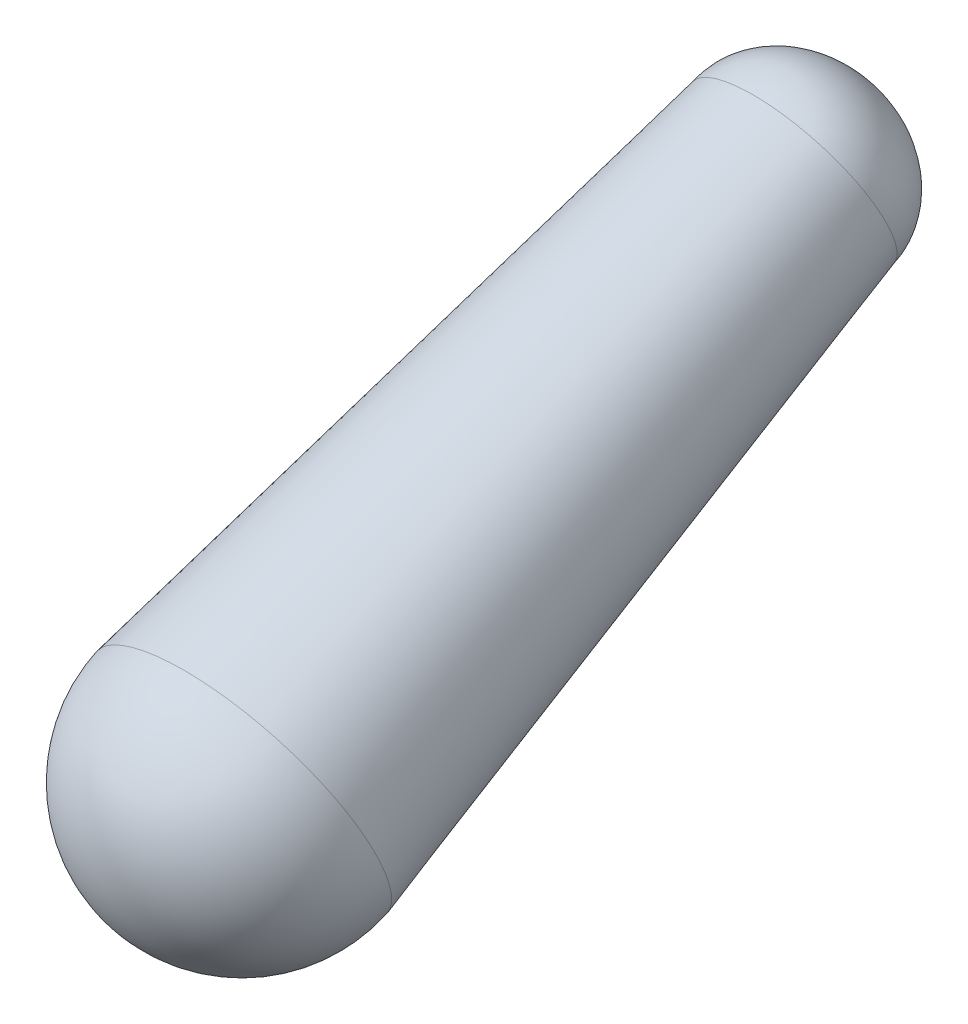
ISO-10303-21;
HEADER;
FILE_DESCRIPTION(('STEP AP214'),'2;1');
FILE_NAME('part.step','',(''),(''),'','','');
FILE_SCHEMA(('AUTOMOTIVE_DESIGN { 1 0 10303 214 1 1 1 1 }'));
ENDSEC;
DATA;
#1=APPLICATION_CONTEXT('core data for automotive mechanical design processes');
#2=APPLICATION_PROTOCOL_DEFINITION('international standard','automotive_design',2000,#1);
#3=PRODUCT_CONTEXT('',#1,'mechanical');
#4=PRODUCT('Part','Part','',(#3));
#5=PRODUCT_RELATED_PRODUCT_CATEGORY('part','',(#4));
#6=PRODUCT_DEFINITION_FORMATION('','',#4);
#7=PRODUCT_DEFINITION_CONTEXT('part definition',#1,'design');
#8=PRODUCT_DEFINITION('design','',#6,#7);
#9=PRODUCT_DEFINITION_SHAPE('','',#8);
#10=(LENGTH_UNIT() NAMED_UNIT(*) SI_UNIT(.MILLI.,.METRE.));
#11=(NAMED_UNIT(*) PLANE_ANGLE_UNIT() SI_UNIT($,.RADIAN.));
#12=(NAMED_UNIT(*) SI_UNIT($,.STERADIAN.) SOLID_ANGLE_UNIT());
#13=UNCERTAINTY_MEASURE_WITH_UNIT(LENGTH_MEASURE(1.E-05),#10,'distance_accuracy_value','');
#14=(GEOMETRIC_REPRESENTATION_CONTEXT(3) GLOBAL_UNCERTAINTY_ASSIGNED_CONTEXT((#13)) GLOBAL_UNIT_ASSIGNED_CONTEXT((#10,
#11,#12)) REPRESENTATION_CONTEXT('',''));
#15=CARTESIAN_POINT('',(0.,0.,0.));
#16=DIRECTION('',(0.,0.,1.));
#17=DIRECTION('',(1.,0.,0.));
#18=AXIS2_PLACEMENT_3D('',#15,#16,#17);
#19=CARTESIAN_POINT('',(0.,-69.9444279441785,-149.459097020143));
#20=DIRECTION('',(0.,-0.416248064887925,0.909251092095609));
#21=DIRECTION('',(0.,-0.909251092095609,-0.416248064887925));
#22=AXIS2_PLACEMENT_3D('',#19,#20,#21);
#23=CONICAL_SURFACE('',#22,10.,0.0698131700797732);
#24=CARTESIAN_POINT('',(0.,-51.695936182814,-189.321050654897));
#25=DIRECTION('',(0.,-0.416248064887925,0.909251092095609));
#26=DIRECTION('',(0.,-0.909251092095609,-0.416248064887925));
#27=AXIS2_PLACEMENT_3D('',#24,#25,#26);
#28=CIRCLE('',#27,6.93437889736927);
#29=CARTESIAN_POINT('',(0.,-58.0010277682518,-192.207472452126));
#30=VERTEX_POINT('',#29);
#31=EDGE_CURVE('E11',#30,#30,#28,.T.);
#32=ORIENTED_EDGE('',*,*,#31,.T.);
#33=EDGE_LOOP('',(#32));
#34=FACE_BOUND('',#33,.T.);
#35=CARTESIAN_POINT('',(0.,-69.9444279441785,-149.459097020143));
#36=DIRECTION('',(0.,-0.416248064887925,0.909251092095609));
#37=DIRECTION('',(0.,-0.909251092095609,-0.416248064887925));
#38=AXIS2_PLACEMENT_3D('',#35,#36,#37);
#39=CIRCLE('',#38,10.);
#40=CARTESIAN_POINT('',(0.,-79.0369388651345,-153.621577669022));
#41=VERTEX_POINT('',#40);
#42=EDGE_CURVE('E44',#41,#41,#39,.T.);
#43=ORIENTED_EDGE('',*,*,#42,.F.);
#44=EDGE_LOOP('',(#43));
#45=FACE_BOUND('',#44,.T.);
#46=ADVANCED_FACE('F36',(#34,#45),#23,.T.);
#47=CARTESIAN_POINT('',(0.,-51.695936182814,-189.321050654897));
#48=DIRECTION('',(-1.,0.,0.));
#49=DIRECTION('',(0.,-0.909251092095609,-0.416248064887924));
#50=AXIS2_PLACEMENT_3D('',#47,#48,#49);
#51=ELLIPSE('',#50,6.93437889736927,6.);
#52=TRIMMED_CURVE('',#51,(PARAMETER_VALUE(4.71238898038469)),
(PARAMETER_VALUE(7.85398163397448)),.T.,.PARAMETER.);
#53=CARTESIAN_POINT('',(0.,-54.1934245721416,-183.865544102323));
#54=DIRECTION('',(0.,0.416248064887925,-0.909251092095609));
#55=AXIS1_PLACEMENT('',#53,#54);
#56=SURFACE_OF_REVOLUTION('',#52,#55);
#57=CARTESIAN_POINT('',(0.,-49.1984477934865,-194.77655720747));
#58=VERTEX_POINT('',#57);
#59=VERTEX_LOOP('',#58);
#60=FACE_BOUND('',#59,.T.);
#61=ORIENTED_EDGE('',*,*,#31,.F.);
#62=EDGE_LOOP('',(#61));
#63=FACE_BOUND('',#62,.T.);
#64=ADVANCED_FACE('F38',(#60,#63),#56,.F.);
#65=CARTESIAN_POINT('',(0.,-69.9444279441785,-149.459097020143));
#66=DIRECTION('',(0.,0.,1.));
#67=DIRECTION('',(1.,0.,0.));
#68=AXIS2_PLACEMENT_3D('',#65,#66,#67);
#69=SPHERICAL_SURFACE('',#68,10.);
#70=CARTESIAN_POINT('',(0.,-69.9444279441785,-149.459097020143));
#71=DIRECTION('',(0.,-0.416248064887925,0.909251092095609));
#72=DIRECTION('',(0.,-0.909251092095609,-0.416248064887925));
#73=AXIS2_PLACEMENT_3D('',#70,#71,#72);
#74=SPHERICAL_SURFACE('',#73,10.);
#75=ORIENTED_EDGE('',*,*,#42,.T.);
#76=EDGE_LOOP('',(#75));
#77=FACE_BOUND('',#76,.T.);
#78=ADVANCED_FACE('F49',(#77),#74,.T.);
#79=CLOSED_SHELL('',(#46,#64,#78));
#80=MANIFOLD_SOLID_BREP('B2',#79);
#81=ADVANCED_BREP_SHAPE_REPRESENTATION('',(#18,#80),#14);
#82=SHAPE_DEFINITION_REPRESENTATION(#9,#81);
ENDSEC;
END-ISO-10303-21;
